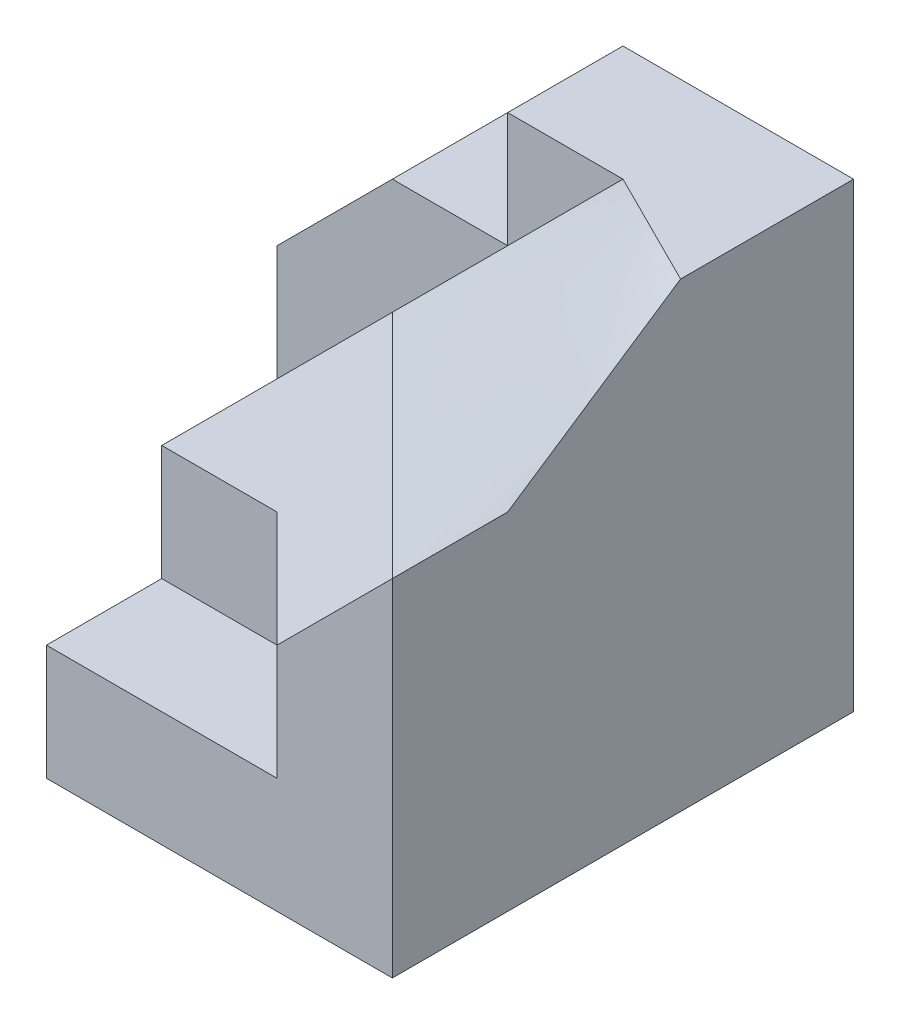
ISO-10303-21;
HEADER;
FILE_DESCRIPTION(('STEP AP214'),'2;1');
FILE_NAME('part.step','',(''),(''),'','','');
FILE_SCHEMA(('AUTOMOTIVE_DESIGN { 1 0 10303 214 1 1 1 1 }'));
ENDSEC;
DATA;
#1=APPLICATION_CONTEXT('core data for automotive mechanical design processes');
#2=APPLICATION_PROTOCOL_DEFINITION('international standard','automotive_design',2000,#1);
#3=PRODUCT_CONTEXT('',#1,'mechanical');
#4=PRODUCT('Part','Part','',(#3));
#5=PRODUCT_RELATED_PRODUCT_CATEGORY('part','',(#4));
#6=PRODUCT_DEFINITION_FORMATION('','',#4);
#7=PRODUCT_DEFINITION_CONTEXT('part definition',#1,'design');
#8=PRODUCT_DEFINITION('design','',#6,#7);
#9=PRODUCT_DEFINITION_SHAPE('','',#8);
#10=(LENGTH_UNIT() NAMED_UNIT(*) SI_UNIT(.MILLI.,.METRE.));
#11=(NAMED_UNIT(*) PLANE_ANGLE_UNIT() SI_UNIT($,.RADIAN.));
#12=(NAMED_UNIT(*) SI_UNIT($,.STERADIAN.) SOLID_ANGLE_UNIT());
#13=UNCERTAINTY_MEASURE_WITH_UNIT(LENGTH_MEASURE(1.E-05),#10,'distance_accuracy_value','');
#14=(GEOMETRIC_REPRESENTATION_CONTEXT(3) GLOBAL_UNCERTAINTY_ASSIGNED_CONTEXT((#13)) GLOBAL_UNIT_ASSIGNED_CONTEXT((#10,
#11,#12)) REPRESENTATION_CONTEXT('',''));
#15=CARTESIAN_POINT('',(0.,0.,0.));
#16=DIRECTION('',(0.,0.,1.));
#17=DIRECTION('',(1.,0.,0.));
#18=AXIS2_PLACEMENT_3D('',#15,#16,#17);
#19=CARTESIAN_POINT('',(10.,20.,15.));
#20=DIRECTION('',(0.,0.,1.));
#21=DIRECTION('',(1.,0.,0.));
#22=AXIS2_PLACEMENT_3D('',#19,#20,#21);
#23=PLANE('',#22);
#24=DIRECTION('',(-1.,0.,0.));
#25=VECTOR('',#24,1.);
#26=CARTESIAN_POINT('',(-5.,5.,15.));
#27=LINE('',#26,#25);
#28=CARTESIAN_POINT('',(-5.07553538217284E-05,5.,15.));
#29=VERTEX_POINT('',#28);
#30=CARTESIAN_POINT('',(-5.,5.,15.));
#31=VERTEX_POINT('',#30);
#32=EDGE_CURVE('E38',#29,#31,#27,.T.);
#33=ORIENTED_EDGE('',*,*,#32,.F.);
#34=DIRECTION('',(0.,-1.,0.));
#35=VECTOR('',#34,1.);
#36=CARTESIAN_POINT('',(-5.07553538217284E-05,10.,15.));
#37=LINE('',#36,#35);
#38=CARTESIAN_POINT('',(-5.07553538217284E-05,10.,15.));
#39=VERTEX_POINT('',#38);
#40=EDGE_CURVE('E59',#39,#29,#37,.T.);
#41=ORIENTED_EDGE('',*,*,#40,.F.);
#42=DIRECTION('',(-1.,0.,0.));
#43=VECTOR('',#42,1.);
#44=CARTESIAN_POINT('',(5.,10.,15.));
#45=LINE('',#44,#43);
#46=CARTESIAN_POINT('',(-5.,10.,15.));
#47=VERTEX_POINT('',#46);
#48=EDGE_CURVE('E286',#39,#47,#45,.T.);
#49=ORIENTED_EDGE('',*,*,#48,.T.);
#50=DIRECTION('',(0.,-1.,0.));
#51=VECTOR('',#50,1.);
#52=CARTESIAN_POINT('',(-5.,20.,15.));
#53=LINE('',#52,#51);
#54=EDGE_CURVE('E287',#47,#31,#53,.T.);
#55=ORIENTED_EDGE('',*,*,#54,.T.);
#56=EDGE_LOOP('',(#33,#41,#49,#55));
#57=FACE_BOUND('',#56,.T.);
#58=ADVANCED_FACE('F33',(#57),#23,.T.);
#59=CARTESIAN_POINT('',(-5.,5.,20.));
#60=DIRECTION('',(0.,-1.,0.));
#61=DIRECTION('',(0.,0.,-1.));
#62=AXIS2_PLACEMENT_3D('',#59,#60,#61);
#63=PLANE('',#62);
#64=DIRECTION('',(0.707106781186547,0.,0.707106781186548));
#65=VECTOR('',#64,1.);
#66=CARTESIAN_POINT('',(4.99994924464618,5.,20.));
#67=LINE('',#66,#65);
#68=CARTESIAN_POINT('',(4.99994924464618,5.,20.));
#69=VERTEX_POINT('',#68);
#70=EDGE_CURVE('E52',#29,#69,#67,.T.);
#71=ORIENTED_EDGE('',*,*,#70,.F.);
#72=ORIENTED_EDGE('',*,*,#32,.T.);
#73=DIRECTION('',(0.,0.,-1.));
#74=VECTOR('',#73,1.);
#75=CARTESIAN_POINT('',(-5.,5.,20.));
#76=LINE('',#75,#74);
#77=CARTESIAN_POINT('',(-5.,5.,20.));
#78=VERTEX_POINT('',#77);
#79=EDGE_CURVE('E225',#78,#31,#76,.T.);
#80=ORIENTED_EDGE('',*,*,#79,.F.);
#81=DIRECTION('',(-1.,0.,0.));
#82=VECTOR('',#81,1.);
#83=CARTESIAN_POINT('',(-5.,5.,20.));
#84=LINE('',#83,#82);
#85=EDGE_CURVE('E224',#69,#78,#84,.T.);
#86=ORIENTED_EDGE('',*,*,#85,.F.);
#87=EDGE_LOOP('',(#71,#72,#80,#86));
#88=FACE_BOUND('',#87,.T.);
#89=ADVANCED_FACE('F264',(#88),#63,.F.);
#90=CARTESIAN_POINT('',(4.99994924464618,5.,20.));
#91=DIRECTION('',(1.,0.,0.));
#92=DIRECTION('',(0.,0.,-1.));
#93=AXIS2_PLACEMENT_3D('',#90,#91,#92);
#94=PLANE('',#93);
#95=DIRECTION('',(0.,0.,-1.));
#96=VECTOR('',#95,1.);
#97=CARTESIAN_POINT('',(4.99994924464618,10.,15.));
#98=LINE('',#97,#96);
#99=CARTESIAN_POINT('',(4.99994924464618,10.,20.));
#100=VERTEX_POINT('',#99);
#101=CARTESIAN_POINT('',(4.9997838308034,10.,15.000221301687));
#102=VERTEX_POINT('',#101);
#103=EDGE_CURVE('E179',#100,#102,#98,.T.);
#104=ORIENTED_EDGE('',*,*,#103,.F.);
#105=DIRECTION('',(0.,-1.,0.));
#106=VECTOR('',#105,1.);
#107=CARTESIAN_POINT('',(4.99994924464618,5.,20.));
#108=LINE('',#107,#106);
#109=CARTESIAN_POINT('',(4.99994924464618,10.0000585638698,20.));
#110=VERTEX_POINT('',#109);
#111=EDGE_CURVE('E181',#110,#100,#108,.T.);
#112=ORIENTED_EDGE('',*,*,#111,.F.);
#113=DIRECTION('',(0.,0.,-1.));
#114=VECTOR('',#113,1.);
#115=CARTESIAN_POINT('',(4.99994924464618,10.0000585638698,20.));
#116=LINE('',#115,#114);
#117=EDGE_CURVE('E177',#110,#102,#116,.T.);
#118=ORIENTED_EDGE('',*,*,#117,.T.);
#119=EDGE_LOOP('',(#104,#112,#118));
#120=FACE_BOUND('',#119,.T.);
#121=ADVANCED_FACE('F178',(#120),#94,.F.);
#122=CARTESIAN_POINT('',(5.,20.,5.));
#123=DIRECTION('',(0.,0.,-1.));
#124=DIRECTION('',(-1.,0.,0.));
#125=AXIS2_PLACEMENT_3D('',#122,#123,#124);
#126=PLANE('',#125);
#127=DIRECTION('',(0.707106781186547,0.707106781186548,0.));
#128=VECTOR('',#127,1.);
#129=CARTESIAN_POINT('',(-10.,10.,5.));
#130=LINE('',#129,#128);
#131=CARTESIAN_POINT('',(-10.,10.,5.));
#132=VERTEX_POINT('',#131);
#133=CARTESIAN_POINT('',(-5.,15.,5.));
#134=VERTEX_POINT('',#133);
#135=EDGE_CURVE('E394',#132,#134,#130,.T.);
#136=ORIENTED_EDGE('',*,*,#135,.F.);
#137=DIRECTION('',(0.,-1.,0.));
#138=VECTOR('',#137,1.);
#139=CARTESIAN_POINT('',(-10.,10.,5.));
#140=LINE('',#139,#138);
#141=CARTESIAN_POINT('',(-10.,5.,5.));
#142=VERTEX_POINT('',#141);
#143=EDGE_CURVE('E375',#132,#142,#140,.T.);
#144=ORIENTED_EDGE('',*,*,#143,.T.);
#145=DIRECTION('',(0.707106781186547,0.707106781186548,0.));
#146=VECTOR('',#145,1.);
#147=CARTESIAN_POINT('',(-10.,5.,5.));
#148=LINE('',#147,#146);
#149=CARTESIAN_POINT('',(-4.99993659023151,9.99992683488251,4.99993171255701));
#150=VERTEX_POINT('',#149);
#151=EDGE_CURVE('E379',#142,#150,#148,.T.);
#152=ORIENTED_EDGE('',*,*,#151,.T.);
#153=CARTESIAN_POINT('',(0.000267019697488768,14.9997314073177,4.99973219381008));
#154=CARTESIAN_POINT('',(-0.208058660414367,14.7913965868046,4.9997276236095));
#155=CARTESIAN_POINT('',(-0.416465346316192,14.5831428484161,4.99980409736613));
#156=CARTESIAN_POINT('',(-0.833305417631473,14.1666661788245,4.99998579822799));
#157=CARTESIAN_POINT('',(-1.04173880276355,13.9584432473398,5.0000910250517));
#158=CARTESIAN_POINT('',(-1.45850646313155,13.5418873448492,5.0001969039904));
#159=CARTESIAN_POINT('',(-1.66684073564951,13.3335543711229,5.00019755338619));
#160=CARTESIAN_POINT('',(-2.08344605673748,12.9168165752041,5.0001313159708));
#161=CARTESIAN_POINT('',(-2.29171710389934,12.7084117516048,5.00006442775209));
#162=CARTESIAN_POINT('',(-2.70826946388126,12.2916135903911,4.99994152713617));
#163=CARTESIAN_POINT('',(-2.91655077666897,12.0832202527443,4.99988551470663));
#164=CARTESIAN_POINT('',(-3.3331845665953,11.666514001042,4.99984928381867));
#165=CARTESIAN_POINT('',(-3.54153704204514,11.4582010852983,4.99986906367172));
#166=CARTESIAN_POINT('',(-3.95831435213359,11.0416535502852,4.99998395120941));
#167=CARTESIAN_POINT('',(-4.16673918570646,10.8334189299496,5.00007905782801));
#168=CARTESIAN_POINT('',(-4.58346960460036,10.4168120935813,5.00014084909085));
#169=CARTESIAN_POINT('',(-4.79177518426433,10.208439871892,5.00010752807815));
#170=CARTESIAN_POINT('',(-4.99991466554323,9.99990153716526,4.99990810135424));
#171=B_SPLINE_CURVE_WITH_KNOTS('',3,(#153,#154,#155,#156,#157,#158,#159,#160,#161,#162,#163,
#164,#165,#166,#167,#168,#169,#170),.UNSPECIFIED.,.F.,.F.,(4,2,2,2,2,2,2,2,4),(0.,
0.883870323287121,1.76773199316225,2.65161664498434,3.53551971792437,4.41942016360728,
5.30330091766094,6.1871691630483,7.0710763412778),.UNSPECIFIED.);
#172=CARTESIAN_POINT('',(8.79215899871924E-06,14.9997409398658,4.99954435897835));
#173=VERTEX_POINT('',#172);
#174=EDGE_CURVE('E166',#173,#150,#171,.T.);
#175=ORIENTED_EDGE('',*,*,#174,.F.);
#176=DIRECTION('',(1.,0.,0.));
#177=VECTOR('',#176,1.);
#178=CARTESIAN_POINT('',(-10.,15.,5.));
#179=LINE('',#178,#177);
#180=EDGE_CURVE('E400',#134,#173,#179,.T.);
#181=ORIENTED_EDGE('',*,*,#180,.F.);
#182=EDGE_LOOP('',(#136,#144,#152,#175,#181));
#183=FACE_BOUND('',#182,.T.);
#184=ADVANCED_FACE('F451',(#183),#126,.F.);
#185=CARTESIAN_POINT('',(10.,20.,0.));
#186=DIRECTION('',(-1.,0.,0.));
#187=DIRECTION('',(0.,0.,1.));
#188=AXIS2_PLACEMENT_3D('',#185,#186,#187);
#189=PLANE('',#188);
#190=CARTESIAN_POINT('',(10.0002258887101,14.9997393591806,14.9997567352352));
#191=CARTESIAN_POINT('',(9.99989931544445,15.2084787118504,14.6875646234766));
#192=CARTESIAN_POINT('',(9.99983475675311,15.4168785515128,14.375146124924));
#193=CARTESIAN_POINT('',(9.99989222067025,15.8334629450422,13.7501081936318));
#194=CARTESIAN_POINT('',(10.000014266989,16.0416474681872,13.4374887404039));
#195=CARTESIAN_POINT('',(10.0001074022782,16.4582020331015,12.8123953977974));
#196=CARTESIAN_POINT('',(10.0000784985747,16.6665720653767,12.4999215020905));
#197=CARTESIAN_POINT('',(10.0000111297537,17.0833217485705,11.8749861282203));
#198=CARTESIAN_POINT('',(9.99997266476329,17.2917013993245,11.5625246499471));
#199=CARTESIAN_POINT('',(9.99996788920212,17.7083729325973,10.9375307583442));
#200=CARTESIAN_POINT('',(10.0000015806196,17.9166648125396,10.624998343297));
#201=CARTESIAN_POINT('',(10.0000324812828,18.333290076531,9.99997368775559));
#202=CARTESIAN_POINT('',(10.0000296915456,18.5416234592611,9.68748144638418));
#203=CARTESIAN_POINT('',(9.99989674830032,18.8542855048358,9.21886164174922));
#204=CARTESIAN_POINT('',(9.99983097709315,18.9585307922104,9.06267837599985));
#205=CARTESIAN_POINT('',(9.99977314201993,19.1669375304943,8.75023065166417));
#206=CARTESIAN_POINT('',(9.99978108631876,19.2710989708387,8.59396618600081));
#207=CARTESIAN_POINT('',(10.0000326991656,19.4791347537077,8.28120606024287));
#208=CARTESIAN_POINT('',(10.0002764104029,19.5830090408227,8.12471036340408));
#209=CARTESIAN_POINT('',(10.0004728648739,19.739028131641,7.89013014346946));
#210=CARTESIAN_POINT('',(10.0005101698614,19.791062963579,7.81197315463619));
#211=CARTESIAN_POINT('',(10.0002898197755,19.8954730110732,7.6559767586361));
#212=CARTESIAN_POINT('',(10.0000323965768,19.9478479268563,7.57813715009606));
#213=CARTESIAN_POINT('',(9.99950860937919,20.0005669888699,7.50052919036129));
#214=B_SPLINE_CURVE_WITH_KNOTS('',3,(#190,#191,#192,#193,#194,#195,#196,#197,#198,#199,#200,
#201,#202,#203,#204,#205,#206,#207,#208,#209,#210,#211,#212,#213),.UNSPECIFIED.,.F.,.F.,(4,2,2,
2,2,2,2,2,2,2,2,4),(0.,1.12664219270157,2.25342754978272,3.38015822185135,4.50687392120386,
5.63362066782605,6.76033600066701,7.32366785996524,7.88706211571614,8.45055840195985,
8.7322401912162,9.01370052203157),.UNSPECIFIED.);
#215=CARTESIAN_POINT('',(10.,14.9995139010449,15.));
#216=VERTEX_POINT('',#215);
#217=CARTESIAN_POINT('',(10.,20.,7.50080606773796));
#218=VERTEX_POINT('',#217);
#219=EDGE_CURVE('E191',#216,#218,#214,.T.);
#220=ORIENTED_EDGE('',*,*,#219,.F.);
#221=DIRECTION('',(0.,0.,-1.));
#222=VECTOR('',#221,1.);
#223=CARTESIAN_POINT('',(10.,14.99967593403,20.));
#224=LINE('',#223,#222);
#225=CARTESIAN_POINT('',(10.,14.99967593403,20.));
#226=VERTEX_POINT('',#225);
#227=EDGE_CURVE('E184',#226,#216,#224,.T.);
#228=ORIENTED_EDGE('',*,*,#227,.F.);
#229=DIRECTION('',(0.,1.,0.));
#230=VECTOR('',#229,1.);
#231=CARTESIAN_POINT('',(10.,5.,20.));
#232=LINE('',#231,#230);
#233=CARTESIAN_POINT('',(10.,0.,20.));
#234=VERTEX_POINT('',#233);
#235=EDGE_CURVE('E222',#234,#226,#232,.T.);
#236=ORIENTED_EDGE('',*,*,#235,.F.);
#237=DIRECTION('',(0.,0.,-1.));
#238=VECTOR('',#237,1.);
#239=CARTESIAN_POINT('',(10.,0.,0.));
#240=LINE('',#239,#238);
#241=CARTESIAN_POINT('',(10.,0.,0.));
#242=VERTEX_POINT('',#241);
#243=EDGE_CURVE('E429',#234,#242,#240,.T.);
#244=ORIENTED_EDGE('',*,*,#243,.T.);
#245=DIRECTION('',(0.,-1.,0.));
#246=VECTOR('',#245,1.);
#247=CARTESIAN_POINT('',(10.,20.,0.));
#248=LINE('',#247,#246);
#249=CARTESIAN_POINT('',(10.,20.,0.));
#250=VERTEX_POINT('',#249);
#251=EDGE_CURVE('E426',#250,#242,#248,.T.);
#252=ORIENTED_EDGE('',*,*,#251,.F.);
#253=DIRECTION('',(0.,0.,-1.));
#254=VECTOR('',#253,1.);
#255=CARTESIAN_POINT('',(10.,20.,0.));
#256=LINE('',#255,#254);
#257=EDGE_CURVE('E430',#218,#250,#256,.T.);
#258=ORIENTED_EDGE('',*,*,#257,.F.);
#259=EDGE_LOOP('',(#220,#228,#236,#244,#252,#258));
#260=FACE_BOUND('',#259,.T.);
#261=ADVANCED_FACE('F35',(#260),#189,.F.);
#262=CARTESIAN_POINT('',(0.,20.,0.));
#263=DIRECTION('',(0.,-1.,0.));
#264=DIRECTION('',(0.,0.,-1.));
#265=AXIS2_PLACEMENT_3D('',#262,#263,#264);
#266=PLANE('',#265);
#267=CARTESIAN_POINT('',(9.99950860937596,20.0005669891816,7.5005291899028));
#268=CARTESIAN_POINT('',(9.79163290147061,19.9998931768866,7.39567045914693));
#269=CARTESIAN_POINT('',(9.58348605606344,19.999714802277,7.29135325781026));
#270=CARTESIAN_POINT('',(9.16685267854684,19.9997499788738,7.08308464373423));
#271=CARTESIAN_POINT('',(8.95836601748139,19.9999637656358,6.9791334884429));
#272=CARTESIAN_POINT('',(8.54153427639803,20.0001836702695,6.77101815423397));
#273=CARTESIAN_POINT('',(8.33318918108827,20.0001898161193,6.66685400590716));
#274=CARTESIAN_POINT('',(7.91657533068559,20.0001149877656,6.45844481528915));
#275=CARTESIAN_POINT('',(7.70830656903248,20.0000340255521,6.35419978610416));
#276=CARTESIAN_POINT('',(7.29175064869152,19.9998901906992,6.14572525163471));
#277=CARTESIAN_POINT('',(7.08346348960002,19.9998273187947,6.04149574715271));
#278=CARTESIAN_POINT('',(6.66675691439989,19.9998751998816,5.8332078970381));
#279=CARTESIAN_POINT('',(6.45833748125645,19.9999859840581,5.72914958550764));
#280=CARTESIAN_POINT('',(6.04151293913319,20.000195893376,5.52102419051378));
#281=CARTESIAN_POINT('',(5.83310782991106,20.0002950189676,5.41695710754451));
#282=CARTESIAN_POINT('',(5.41653817283608,20.0002156350948,5.20856378771429));
#283=CARTESIAN_POINT('',(5.20837356038323,20.0000372436277,5.10423767981608));
#284=CARTESIAN_POINT('',(5.00035766050937,19.9995873147969,4.99961482714375));
#285=B_SPLINE_CURVE_WITH_KNOTS('',3,(#267,#268,#269,#270,#271,#272,#273,#274,#275,#276,#277,
#278,#279,#280,#281,#282,#283,#284),.UNSPECIFIED.,.F.,.F.,(4,2,2,2,2,2,2,2,4),(0.,
0.698473889705523,1.39736746211624,2.09616686339957,2.7948700908577,3.49360169599927,
4.19245879328016,4.89128889407521,5.5898219414062),.UNSPECIFIED.);
#286=CARTESIAN_POINT('',(5.00017883025469,19.9998968286992,4.99990370678594));
#287=VERTEX_POINT('',#286);
#288=EDGE_CURVE('E707',#218,#287,#285,.T.);
#289=ORIENTED_EDGE('',*,*,#288,.F.);
#290=ORIENTED_EDGE('',*,*,#257,.T.);
#291=DIRECTION('',(-1.,0.,0.));
#292=VECTOR('',#291,1.);
#293=CARTESIAN_POINT('',(0.,20.,0.));
#294=LINE('',#293,#292);
#295=CARTESIAN_POINT('',(0.,20.,0.));
#296=VERTEX_POINT('',#295);
#297=EDGE_CURVE('E431',#250,#296,#294,.T.);
#298=ORIENTED_EDGE('',*,*,#297,.T.);
#299=DIRECTION('',(0.,0.,1.));
#300=VECTOR('',#299,1.);
#301=CARTESIAN_POINT('',(0.,20.,5.));
#302=LINE('',#301,#300);
#303=CARTESIAN_POINT('',(0.,20.,5.));
#304=VERTEX_POINT('',#303);
#305=EDGE_CURVE('E288',#296,#304,#302,.T.);
#306=ORIENTED_EDGE('',*,*,#305,.T.);
#307=DIRECTION('',(-1.,0.,0.));
#308=VECTOR('',#307,1.);
#309=CARTESIAN_POINT('',(5.,20.,5.));
#310=LINE('',#309,#308);
#311=EDGE_CURVE('E44',#287,#304,#310,.T.);
#312=ORIENTED_EDGE('',*,*,#311,.F.);
#313=EDGE_LOOP('',(#289,#290,#298,#306,#312));
#314=FACE_BOUND('',#313,.T.);
#315=ADVANCED_FACE('F246',(#314),#266,.F.);
#316=CARTESIAN_POINT('',(0.,20.,5.));
#317=DIRECTION('',(1.,0.,0.));
#318=DIRECTION('',(0.,0.,-1.));
#319=AXIS2_PLACEMENT_3D('',#316,#317,#318);
#320=PLANE('',#319);
#321=DIRECTION('',(0.,0.,-1.));
#322=VECTOR('',#321,1.);
#323=CARTESIAN_POINT('',(0.,15.,5.));
#324=LINE('',#323,#322);
#325=CARTESIAN_POINT('',(0.,15.,0.));
#326=VERTEX_POINT('',#325);
#327=EDGE_CURVE('E408',#173,#326,#324,.T.);
#328=ORIENTED_EDGE('',*,*,#327,.F.);
#329=DIRECTION('',(0.,-1.,0.));
#330=VECTOR('',#329,1.);
#331=CARTESIAN_POINT('',(0.,20.,5.));
#332=LINE('',#331,#330);
#333=EDGE_CURVE('E11',#304,#173,#332,.T.);
#334=ORIENTED_EDGE('',*,*,#333,.F.);
#335=ORIENTED_EDGE('',*,*,#305,.F.);
#336=DIRECTION('',(0.,-1.,0.));
#337=VECTOR('',#336,1.);
#338=CARTESIAN_POINT('',(0.,20.,0.));
#339=LINE('',#338,#337);
#340=EDGE_CURVE('E378',#296,#326,#339,.T.);
#341=ORIENTED_EDGE('',*,*,#340,.T.);
#342=EDGE_LOOP('',(#328,#334,#335,#341));
#343=FACE_BOUND('',#342,.T.);
#344=ADVANCED_FACE('F255',(#343),#320,.F.);
#345=CARTESIAN_POINT('',(0.,20.,0.));
#346=DIRECTION('',(0.,0.,1.));
#347=DIRECTION('',(1.,0.,0.));
#348=AXIS2_PLACEMENT_3D('',#345,#346,#347);
#349=PLANE('',#348);
#350=DIRECTION('',(0.,-1.,0.));
#351=VECTOR('',#350,1.);
#352=CARTESIAN_POINT('',(-10.,15.,0.));
#353=LINE('',#352,#351);
#354=CARTESIAN_POINT('',(-10.,10.,0.));
#355=VERTEX_POINT('',#354);
#356=CARTESIAN_POINT('',(-10.,0.,0.));
#357=VERTEX_POINT('',#356);
#358=EDGE_CURVE('E405',#355,#357,#353,.T.);
#359=ORIENTED_EDGE('',*,*,#358,.F.);
#360=DIRECTION('',(0.707106781186547,0.707106781186548,0.));
#361=VECTOR('',#360,1.);
#362=CARTESIAN_POINT('',(0.,20.,0.));
#363=LINE('',#362,#361);
#364=CARTESIAN_POINT('',(-5.,15.,0.));
#365=VERTEX_POINT('',#364);
#366=EDGE_CURVE('E401',#355,#365,#363,.T.);
#367=ORIENTED_EDGE('',*,*,#366,.T.);
#368=DIRECTION('',(1.,0.,0.));
#369=VECTOR('',#368,1.);
#370=CARTESIAN_POINT('',(-10.,15.,0.));
#371=LINE('',#370,#369);
#372=EDGE_CURVE('E404',#365,#326,#371,.T.);
#373=ORIENTED_EDGE('',*,*,#372,.T.);
#374=ORIENTED_EDGE('',*,*,#340,.F.);
#375=ORIENTED_EDGE('',*,*,#297,.F.);
#376=ORIENTED_EDGE('',*,*,#251,.T.);
#377=DIRECTION('',(-1.,0.,0.));
#378=VECTOR('',#377,1.);
#379=CARTESIAN_POINT('',(0.,0.,0.));
#380=LINE('',#379,#378);
#381=EDGE_CURVE('E374',#242,#357,#380,.T.);
#382=ORIENTED_EDGE('',*,*,#381,.T.);
#383=EDGE_LOOP('',(#359,#367,#373,#374,#375,#376,#382));
#384=FACE_BOUND('',#383,.T.);
#385=ADVANCED_FACE('F462',(#384),#349,.F.);
#386=CARTESIAN_POINT('',(0.,0.,0.));
#387=DIRECTION('',(0.,-1.,0.));
#388=DIRECTION('',(0.,0.,-1.));
#389=AXIS2_PLACEMENT_3D('',#386,#387,#388);
#390=PLANE('',#389);
#391=ORIENTED_EDGE('',*,*,#243,.F.);
#392=DIRECTION('',(1.,0.,0.));
#393=VECTOR('',#392,1.);
#394=CARTESIAN_POINT('',(10.,0.,20.));
#395=LINE('',#394,#393);
#396=CARTESIAN_POINT('',(-5.,0.,20.));
#397=VERTEX_POINT('',#396);
#398=EDGE_CURVE('E219',#397,#234,#395,.T.);
#399=ORIENTED_EDGE('',*,*,#398,.F.);
#400=DIRECTION('',(0.,0.,-1.));
#401=VECTOR('',#400,1.);
#402=CARTESIAN_POINT('',(-5.,0.,5.));
#403=LINE('',#402,#401);
#404=CARTESIAN_POINT('',(-5.,0.,10.));
#405=VERTEX_POINT('',#404);
#406=EDGE_CURVE('E370',#397,#405,#403,.T.);
#407=ORIENTED_EDGE('',*,*,#406,.T.);
#408=DIRECTION('',(1.,0.,0.));
#409=VECTOR('',#408,1.);
#410=CARTESIAN_POINT('',(-5.,0.,10.));
#411=LINE('',#410,#409);
#412=CARTESIAN_POINT('',(-10.,0.,10.));
#413=VERTEX_POINT('',#412);
#414=EDGE_CURVE('E384',#413,#405,#411,.T.);
#415=ORIENTED_EDGE('',*,*,#414,.F.);
#416=DIRECTION('',(0.,0.,1.));
#417=VECTOR('',#416,1.);
#418=CARTESIAN_POINT('',(-10.,0.,0.));
#419=LINE('',#418,#417);
#420=EDGE_CURVE('E407',#357,#413,#419,.T.);
#421=ORIENTED_EDGE('',*,*,#420,.F.);
#422=ORIENTED_EDGE('',*,*,#381,.F.);
#423=EDGE_LOOP('',(#391,#399,#407,#415,#421,#422));
#424=FACE_BOUND('',#423,.T.);
#425=ADVANCED_FACE('F465',(#424),#390,.T.);
#426=CARTESIAN_POINT('',(-10.,15.,5.));
#427=DIRECTION('',(0.,-1.,0.));
#428=DIRECTION('',(0.,0.,-1.));
#429=AXIS2_PLACEMENT_3D('',#426,#427,#428);
#430=PLANE('',#429);
#431=ORIENTED_EDGE('',*,*,#372,.F.);
#432=DIRECTION('',(0.,0.,1.));
#433=VECTOR('',#432,1.);
#434=CARTESIAN_POINT('',(-5.,15.,-5.));
#435=LINE('',#434,#433);
#436=EDGE_CURVE('E373',#365,#134,#435,.T.);
#437=ORIENTED_EDGE('',*,*,#436,.T.);
#438=ORIENTED_EDGE('',*,*,#180,.T.);
#439=ORIENTED_EDGE('',*,*,#327,.T.);
#440=EDGE_LOOP('',(#431,#437,#438,#439));
#441=FACE_BOUND('',#440,.T.);
#442=ADVANCED_FACE('F469',(#441),#430,.F.);
#443=CARTESIAN_POINT('',(-10.,0.,0.));
#444=DIRECTION('',(-1.,0.,0.));
#445=DIRECTION('',(0.,0.,1.));
#446=AXIS2_PLACEMENT_3D('',#443,#444,#445);
#447=PLANE('',#446);
#448=DIRECTION('',(0.,0.,1.));
#449=VECTOR('',#448,1.);
#450=CARTESIAN_POINT('',(-10.,5.,5.));
#451=LINE('',#450,#449);
#452=CARTESIAN_POINT('',(-10.,5.,10.));
#453=VERTEX_POINT('',#452);
#454=EDGE_CURVE('E385',#142,#453,#451,.T.);
#455=ORIENTED_EDGE('',*,*,#454,.F.);
#456=ORIENTED_EDGE('',*,*,#143,.F.);
#457=DIRECTION('',(0.,0.,1.));
#458=VECTOR('',#457,1.);
#459=CARTESIAN_POINT('',(-10.,10.,0.));
#460=LINE('',#459,#458);
#461=EDGE_CURVE('E397',#355,#132,#460,.T.);
#462=ORIENTED_EDGE('',*,*,#461,.F.);
#463=ORIENTED_EDGE('',*,*,#358,.T.);
#464=ORIENTED_EDGE('',*,*,#420,.T.);
#465=DIRECTION('',(0.,-1.,0.));
#466=VECTOR('',#465,1.);
#467=CARTESIAN_POINT('',(-10.,0.,10.));
#468=LINE('',#467,#466);
#469=EDGE_CURVE('E387',#453,#413,#468,.T.);
#470=ORIENTED_EDGE('',*,*,#469,.F.);
#471=EDGE_LOOP('',(#455,#456,#462,#463,#464,#470));
#472=FACE_BOUND('',#471,.T.);
#473=ADVANCED_FACE('F473',(#472),#447,.T.);
#474=CARTESIAN_POINT('',(-10.,10.,-5.));
#475=DIRECTION('',(0.707106781186548,-0.707106781186547,0.));
#476=DIRECTION('',(0.707106781186547,0.707106781186548,0.));
#477=AXIS2_PLACEMENT_3D('',#474,#475,#476);
#478=PLANE('',#477);
#479=ORIENTED_EDGE('',*,*,#461,.T.);
#480=ORIENTED_EDGE('',*,*,#135,.T.);
#481=ORIENTED_EDGE('',*,*,#436,.F.);
#482=ORIENTED_EDGE('',*,*,#366,.F.);
#483=EDGE_LOOP('',(#479,#480,#481,#482));
#484=FACE_BOUND('',#483,.T.);
#485=ADVANCED_FACE('F477',(#484),#478,.F.);
#486=CARTESIAN_POINT('',(0.,0.,10.));
#487=DIRECTION('',(0.,0.,-1.));
#488=DIRECTION('',(-1.,0.,0.));
#489=AXIS2_PLACEMENT_3D('',#486,#487,#488);
#490=PLANE('',#489);
#491=DIRECTION('',(0.,1.,0.));
#492=VECTOR('',#491,1.);
#493=CARTESIAN_POINT('',(-5.,10.,10.));
#494=LINE('',#493,#492);
#495=CARTESIAN_POINT('',(-5.,10.,10.));
#496=VERTEX_POINT('',#495);
#497=EDGE_CURVE('E389',#405,#496,#494,.T.);
#498=ORIENTED_EDGE('',*,*,#497,.T.);
#499=DIRECTION('',(0.707106781186547,0.707106781186548,0.));
#500=VECTOR('',#499,1.);
#501=CARTESIAN_POINT('',(-10.,5.,10.));
#502=LINE('',#501,#500);
#503=EDGE_CURVE('E380',#453,#496,#502,.T.);
#504=ORIENTED_EDGE('',*,*,#503,.F.);
#505=ORIENTED_EDGE('',*,*,#469,.T.);
#506=ORIENTED_EDGE('',*,*,#414,.T.);
#507=EDGE_LOOP('',(#498,#504,#505,#506));
#508=FACE_BOUND('',#507,.T.);
#509=ADVANCED_FACE('F480',(#508),#490,.F.);
#510=CARTESIAN_POINT('',(-10.,5.,5.));
#511=DIRECTION('',(0.707106781186548,-0.707106781186547,0.));
#512=DIRECTION('',(0.707106781186547,0.707106781186548,0.));
#513=AXIS2_PLACEMENT_3D('',#510,#511,#512);
#514=PLANE('',#513);
#515=ORIENTED_EDGE('',*,*,#503,.T.);
#516=DIRECTION('',(0.,0.,-1.));
#517=VECTOR('',#516,1.);
#518=CARTESIAN_POINT('',(-5.,10.,10.));
#519=LINE('',#518,#517);
#520=EDGE_CURVE('E383',#496,#150,#519,.T.);
#521=ORIENTED_EDGE('',*,*,#520,.T.);
#522=ORIENTED_EDGE('',*,*,#151,.F.);
#523=ORIENTED_EDGE('',*,*,#454,.T.);
#524=EDGE_LOOP('',(#515,#521,#522,#523));
#525=FACE_BOUND('',#524,.T.);
#526=ADVANCED_FACE('F260',(#525),#514,.F.);
#527=CARTESIAN_POINT('',(-5.,20.,5.));
#528=DIRECTION('',(-1.,0.,0.));
#529=DIRECTION('',(0.,0.,1.));
#530=AXIS2_PLACEMENT_3D('',#527,#528,#529);
#531=PLANE('',#530);
#532=DIRECTION('',(0.,0.,1.));
#533=VECTOR('',#532,1.);
#534=CARTESIAN_POINT('',(-5.,10.,5.00000000000001));
#535=LINE('',#534,#533);
#536=EDGE_CURVE('E192',#496,#47,#535,.T.);
#537=ORIENTED_EDGE('',*,*,#536,.F.);
#538=ORIENTED_EDGE('',*,*,#497,.F.);
#539=ORIENTED_EDGE('',*,*,#406,.F.);
#540=DIRECTION('',(0.,-1.,0.));
#541=VECTOR('',#540,1.);
#542=CARTESIAN_POINT('',(-5.,0.,20.));
#543=LINE('',#542,#541);
#544=EDGE_CURVE('E216',#78,#397,#543,.T.);
#545=ORIENTED_EDGE('',*,*,#544,.F.);
#546=ORIENTED_EDGE('',*,*,#79,.T.);
#547=ORIENTED_EDGE('',*,*,#54,.F.);
#548=EDGE_LOOP('',(#537,#538,#539,#545,#546,#547));
#549=FACE_BOUND('',#548,.T.);
#550=ADVANCED_FACE('F257',(#549),#531,.T.);
#551=CARTESIAN_POINT('',(-5.,10.,5.));
#552=DIRECTION('',(0.,-1.,0.));
#553=DIRECTION('',(0.,0.,-1.));
#554=AXIS2_PLACEMENT_3D('',#551,#552,#553);
#555=PLANE('',#554);
#556=ORIENTED_EDGE('',*,*,#520,.F.);
#557=ORIENTED_EDGE('',*,*,#536,.T.);
#558=ORIENTED_EDGE('',*,*,#48,.F.);
#559=DIRECTION('',(0.707106781186547,0.,0.707106781186548));
#560=VECTOR('',#559,1.);
#561=CARTESIAN_POINT('',(4.99994924464618,10.,20.));
#562=LINE('',#561,#560);
#563=EDGE_CURVE('E198',#39,#100,#562,.T.);
#564=ORIENTED_EDGE('',*,*,#563,.T.);
#565=ORIENTED_EDGE('',*,*,#103,.T.);
#566=CARTESIAN_POINT('',(-4.99991466554323,9.99990153716527,4.99990810135424));
#567=CARTESIAN_POINT('',(-4.58327193994,9.9999291235409,5.41660048243364));
#568=CARTESIAN_POINT('',(-4.16663159758555,9.99995935919248,5.83329524896092));
#569=CARTESIAN_POINT('',(-3.33333673980218,10.0000034769495,6.66666951870695));
#570=CARTESIAN_POINT('',(-2.91668222439255,10.0000173590764,7.083349021945));
#571=CARTESIAN_POINT('',(-2.08333973013762,10.0000071178811,7.91667308204828));
#572=CARTESIAN_POINT('',(-1.66665175135316,9.99998299462639,8.33331763897435));
#573=CARTESIAN_POINT('',(-0.833306935253814,9.99996970244996,9.16663852915613));
#574=CARTESIAN_POINT('',(-0.416650097962896,9.99998053355483,9.58331486243581));
#575=CARTESIAN_POINT('',(0.416703413504834,9.9999575771204,10.4166270523215));
#576=CARTESIAN_POINT('',(0.833400087650624,9.99992378961556,10.8332629089586));
#577=CARTESIAN_POINT('',(1.66671823452476,9.99994175789985,11.6666133987445));
#578=CARTESIAN_POINT('',(2.08333970692108,9.99999351405784,12.0833280322252));
#579=CARTESIAN_POINT('',(2.91655833686461,10.0001224228145,12.9167786979307));
#580=CARTESIAN_POINT('',(3.3331554944928,10.0001995753231,13.3335147300744));
#581=CARTESIAN_POINT('',(3.95835420788203,9.99997585062295,13.9583107390033));
#582=CARTESIAN_POINT('',(4.16680302771947,9.99984470194496,14.1665234912204));
#583=CARTESIAN_POINT('',(4.5835148688184,9.99979678806524,14.5831490873358));
#584=CARTESIAN_POINT('',(4.7917778834213,9.99988003026036,14.79156193789));
#585=CARTESIAN_POINT('',(4.99979697858472,10.0002342554792,15.0002186384472));
#586=B_SPLINE_CURVE_WITH_KNOTS('',3,(#566,#567,#568,#569,#570,#571,#572,#573,#574,#575,#576,
#577,#578,#579,#580,#581,#582,#583,#584,#585),.UNSPECIFIED.,.F.,.F.,(4,2,2,2,2,2,2,2,2,4),(0.,
1.76777072331766,3.535539129875,5.30330439192821,7.07107100112889,8.83883624473996,
10.6066091110613,12.3743757084601,13.2582484359328,14.142151658886),.UNSPECIFIED.);
#587=EDGE_CURVE('E156',#150,#102,#586,.T.);
#588=ORIENTED_EDGE('',*,*,#587,.F.);
#589=EDGE_LOOP('',(#556,#557,#558,#564,#565,#588));
#590=FACE_BOUND('',#589,.T.);
#591=ADVANCED_FACE('F196',(#590),#555,.F.);
#592=CARTESIAN_POINT('',(-0.172002880453976,4.93434609907043,15.2025865990224));
#593=CARTESIAN_POINT('',(-0.670469575529322,5.43633330030541,14.2737383636295));
#594=CARTESIAN_POINT('',(-1.15730393307148,5.92489857361752,13.3323629955086));
#595=CARTESIAN_POINT('',(-1.63217143618203,6.39965593797012,12.3781002456921));
#596=CARTESIAN_POINT('',(-2.29150946895763,7.05648836831382,11.0060092292114));
#597=CARTESIAN_POINT('',(-2.93866714451758,7.6992665403318,9.62080090496004));
#598=CARTESIAN_POINT('',(-3.12955813557624,7.88874983100783,9.20988698133508));
#599=CARTESIAN_POINT('',(-3.64675687856133,8.40201046358576,8.09407373660222));
#600=CARTESIAN_POINT('',(-4.16544746201132,8.9169924505463,6.97986708929311));
#601=CARTESIAN_POINT('',(-4.49593735638006,9.24559534142012,6.27947161389233));
#602=CARTESIAN_POINT('',(-4.83244980025175,9.58114732787429,5.58556196103307));
#603=CARTESIAN_POINT('',(-5.17567068065548,9.92443981801935,4.89887677828524));
#604=CARTESIAN_POINT('',(0.885515925463134,5.9223380165844,15.1679418909696));
#605=CARTESIAN_POINT('',(0.388755329867943,6.42235664149616,14.237256317675));
#606=CARTESIAN_POINT('',(-0.0963630597936832,6.9089419518692,13.2940329841442));
#607=CARTESIAN_POINT('',(-0.570103216724442,7.38239853216823,12.338556169211));
#608=CARTESIAN_POINT('',(-1.22931576880327,8.03908617709261,10.9663300196723));
#609=CARTESIAN_POINT('',(-1.8799098816445,8.68582946905058,9.58482247403153));
#610=CARTESIAN_POINT('',(-2.07213742591872,8.87685493651377,9.17534791540795));
#611=CARTESIAN_POINT('',(-2.59415866654865,9.39567998945125,8.06472812967712));
#612=CARTESIAN_POINT('',(-3.12064541185936,9.91965754778946,6.95891734898729));
#613=CARTESIAN_POINT('',(-3.45730641860366,10.255380952943,6.26516768691395));
#614=CARTESIAN_POINT('',(-3.80180703053846,10.600150056393,5.57986067658419));
#615=CARTESIAN_POINT('',(-4.15317409512764,10.9528419898288,4.90194830757448));
#616=CARTESIAN_POINT('',(1.93884059370532,6.91516932372331,15.1378139465666));
#617=CARTESIAN_POINT('',(1.44432994212781,7.41259185938387,14.2047053566375));
#618=CARTESIAN_POINT('',(0.961289873831772,7.89677910664292,13.259243830867));
#619=CARTESIAN_POINT('',(0.490044208898135,8.36735742694523,12.3010806399369));
#620=CARTESIAN_POINT('',(-0.167796809071122,9.02246253251244,10.9273774536647));
#621=CARTESIAN_POINT('',(-0.820543009441859,9.67168900238908,9.54818754074815));
#622=CARTESIAN_POINT('',(-1.01390878796832,9.86402781706641,9.1399387728577));
#623=CARTESIAN_POINT('',(-1.53967480240274,10.387173762855,8.03335182045496));
#624=CARTESIAN_POINT('',(-2.07376243122065,10.9199215713943,6.93572660661869));
#625=CARTESIAN_POINT('',(-2.41649814671295,11.262654255872,6.24851893858163));
#626=CARTESIAN_POINT('',(-2.76658043563509,11.613863755846,5.56922296500745));
#627=CARTESIAN_POINT('',(-3.12491143361516,11.9745909970406,4.89881021657243));
#628=CARTESIAN_POINT('',(2.98836016498954,7.91239112735225,15.1117837988875));
#629=CARTESIAN_POINT('',(2.4965242155617,8.40672746822485,14.1757947604897));
#630=CARTESIAN_POINT('',(2.01597069710329,8.88804561951717,13.2276554118169));
#631=CARTESIAN_POINT('',(1.54685480976625,9.35616650413121,12.2671986142444));
#632=CARTESIAN_POINT('',(0.893145047524985,10.0065047761662,10.8890463833422));
#633=CARTESIAN_POINT('',(0.23973898699559,10.656492623149,9.51056708905787));
#634=CARTESIAN_POINT('',(0.0459201214905334,10.849354230494,9.10280626099058));
#635=CARTESIAN_POINT('',(-0.483391746382935,11.3765915456356,8.0000379199835));
#636=CARTESIAN_POINT('',(-1.02437893408546,11.9173003836567,6.9098430003309));
#637=CARTESIAN_POINT('',(-1.37459364582949,12.2686626791944,6.23068963594946));
#638=CARTESIAN_POINT('',(-1.73524901129428,12.6320718828713,5.56278005249805));
#639=CARTESIAN_POINT('',(-2.10635474720655,13.0075392062954,4.906124714144));
#640=CARTESIAN_POINT('',(5.0336870982944,9.91445651968026,15.0903875780675));
#641=CARTESIAN_POINT('',(4.54698301799253,10.4028714730998,14.14887191138));
#642=CARTESIAN_POINT('',(4.07977403746161,10.86879208063,13.1863615218626));
#643=CARTESIAN_POINT('',(3.6333032820381,11.3107839668824,12.2015176591525));
#644=CARTESIAN_POINT('',(2.99247730435454,11.9462563336586,10.8094905833419));
#645=CARTESIAN_POINT('',(2.34157285177697,12.5933577099278,9.42831724972489));
#646=CARTESIAN_POINT('',(2.14707968718538,12.7869973546803,9.02128258990457));
#647=CARTESIAN_POINT('',(1.61379387966127,13.3188199848033,7.92279387621367));
#648=CARTESIAN_POINT('',(1.05712313883078,13.8776252302799,6.84948893685251));
#649=CARTESIAN_POINT('',(0.694640850478664,14.2431424219037,6.18354680881832));
#650=CARTESIAN_POINT('',(0.31553209598411,14.6278439975381,5.53551010586051));
#651=CARTESIAN_POINT('',(-0.0792497976429223,15.0306299644789,4.9043521681221));
#652=CARTESIAN_POINT('',(7.04149126613717,11.9598174106191,15.1094004892836));
#653=CARTESIAN_POINT('',(6.6071590615382,12.3878032766893,14.1114843410702));
#654=CARTESIAN_POINT('',(6.16845604311602,12.8208323894785,13.1182752231278));
#655=CARTESIAN_POINT('',(5.72763369275442,13.2563068852747,12.1273484626586));
#656=CARTESIAN_POINT('',(5.10293445700116,13.8731714729005,10.7179541263077));
#657=CARTESIAN_POINT('',(4.45550297257141,14.5162655782299,9.33304067314683));
#658=CARTESIAN_POINT('',(4.26135756817701,14.7095039612164,8.92563150234496));
#659=CARTESIAN_POINT('',(3.72393872054233,15.2460954837747,7.83159375492686));
#660=CARTESIAN_POINT('',(3.1529413541028,15.8214314511077,6.77371748929864));
#661=CARTESIAN_POINT('',(2.77122668891414,16.2091398467737,6.12848715170368));
#662=CARTESIAN_POINT('',(2.36587248511128,16.6241246331483,5.50871477877019));
#663=CARTESIAN_POINT('',(1.93514191514857,17.0683898420153,4.91627080016278));
#664=CARTESIAN_POINT('',(8.04838360661435,12.9518706395605,15.1020967470357));
#665=CARTESIAN_POINT('',(7.63064796283878,13.3607066277579,14.0863073794739));
#666=CARTESIAN_POINT('',(7.20567229070304,13.777896494832,13.0783149655308));
#667=CARTESIAN_POINT('',(6.77031408566755,14.2070662075599,12.0815037408643));
#668=CARTESIAN_POINT('',(6.14705285694996,14.8222715562982,10.6705607815519));
#669=CARTESIAN_POINT('',(5.50261848783269,15.4619074516517,9.28241966574681));
#670=CARTESIAN_POINT('',(5.30913233095062,15.6543851644316,8.87430053608549));
#671=CARTESIAN_POINT('',(4.77587771911569,16.1861717995286,7.77577822703697));
#672=CARTESIAN_POINT('',(4.20046329432751,16.7666043726486,6.72265879347648));
#673=CARTESIAN_POINT('',(3.81549190517877,17.15807052673,6.08093569706948));
#674=CARTESIAN_POINT('',(3.39329743505813,17.5924863896253,5.47929899555511));
#675=CARTESIAN_POINT('',(2.93943104347299,18.0634467772869,4.91177051715621));
#676=CARTESIAN_POINT('',(9.57180567367384,14.504431852966,15.1168443194186));
#677=CARTESIAN_POINT('',(9.18979534200571,14.8720463271928,14.0625815388179));
#678=CARTESIAN_POINT('',(8.78638011095876,15.2643587622416,13.0313701883175));
#679=CARTESIAN_POINT('',(8.3608888915992,15.6821434914969,12.0239329790769));
#680=CARTESIAN_POINT('',(7.74293470517622,16.2912253298955,10.6072747434472));
#681=CARTESIAN_POINT('',(7.09502686534449,16.9348690760732,9.22287428841156));
#682=CARTESIAN_POINT('',(6.90033033483151,17.1287433738119,8.81605863804507));
#683=CARTESIAN_POINT('',(6.35792233174126,17.6710916142035,7.72739382727149));
#684=CARTESIAN_POINT('',(5.77640709079511,18.2585635905826,6.68084450341965));
#685=CARTESIAN_POINT('',(5.37830448479812,18.6651811487197,6.05326271746445));
#686=CARTESIAN_POINT('',(4.94189449819434,19.1159995306339,5.46693503370131));
#687=CARTESIAN_POINT('',(4.46077370813308,19.6184073011531,4.92875744596927));
#688=CARTESIAN_POINT('',(11.1143750242928,16.0349000468789,15.1109717402757));
#689=CARTESIAN_POINT('',(10.7805787479755,16.3468829187779,14.0047861308358));
#690=CARTESIAN_POINT('',(10.417730372531,16.6923874435159,12.9298873973789));
#691=CARTESIAN_POINT('',(10.021620812672,17.0762702579633,11.8908084009839));
#692=CARTESIAN_POINT('',(9.43171555799973,17.6529879443417,10.4439436234687));
#693=CARTESIAN_POINT('',(8.7907298594299,18.2886446044481,9.05208855476635));
#694=CARTESIAN_POINT('',(8.5962455791215,18.4822739981046,8.64504432725646));
#695=CARTESIAN_POINT('',(8.05736635840587,19.0205505665255,7.55257928931018));
#696=CARTESIAN_POINT('',(7.45341533868131,19.6339099799566,6.53019157337352));
#697=CARTESIAN_POINT('',(7.03767600520174,20.060877608266,5.92160318624583));
#698=CARTESIAN_POINT('',(6.5489917158766,20.5720124933203,5.39157090541329));
#699=CARTESIAN_POINT('',(6.00244739268072,21.1499089559176,4.92384943028777));
#700=CARTESIAN_POINT('',(11.6716158039342,16.5484337393505,15.0891803823811));
#701=CARTESIAN_POINT('',(11.3472762442356,16.849505015151,13.9728106165825));
#702=CARTESIAN_POINT('',(10.9972238185788,17.1802449824418,12.8841316295082));
#703=CARTESIAN_POINT('',(10.6154927276516,17.547537255814,11.8295681281097));
#704=CARTESIAN_POINT('',(10.0396930654605,18.1079792585604,10.3675127125379));
#705=CARTESIAN_POINT('',(9.40383490374075,18.7377195299937,8.97013568107394));
#706=CARTESIAN_POINT('',(9.21069439957437,18.929798412717,8.56164431002645));
#707=CARTESIAN_POINT('',(8.66577111877596,19.4750488966181,7.47568825986168));
#708=CARTESIAN_POINT('',(8.0726327161055,20.0759322134483,6.44165618709753));
#709=CARTESIAN_POINT('',(7.63594964439589,20.5270656935617,5.85562259498673));
#710=CARTESIAN_POINT('',(7.14644661822609,21.039145274975,5.32647203075622));
#711=CARTESIAN_POINT('',(6.60200823315334,21.6146118089688,4.8564826222673));
#712=CARTESIAN_POINT('',(12.2425556838977,17.0461607776043,15.0526361472166));
#713=CARTESIAN_POINT('',(11.9333759741384,17.3297399188595,13.9199403891757));
#714=CARTESIAN_POINT('',(11.5957680814917,17.6461208096003,12.8178595973213));
#715=CARTESIAN_POINT('',(11.2290071236981,17.9961398524336,11.7471744140866));
#716=CARTESIAN_POINT('',(10.6712748620155,18.5357348545935,10.2656617979672));
#717=CARTESIAN_POINT('',(10.0510183765567,19.1474731918794,8.85148296129911));
#718=CARTESIAN_POINT('',(9.8600207086519,19.3370795712242,8.44068392043154));
#719=CARTESIAN_POINT('',(9.33443068970863,19.8600224452922,7.3339074344226));
#720=CARTESIAN_POINT('',(8.72847476486421,20.4756952107849,6.31367884707669));
#721=CARTESIAN_POINT('',(8.28723745369146,20.9320835825863,5.73254982054153));
#722=CARTESIAN_POINT('',(7.78781913644607,21.4556038844716,5.21407726208472));
#723=CARTESIAN_POINT('',(7.23056087927692,22.0458625785766,4.75789386969964));
#724=CARTESIAN_POINT('',(12.8308207730982,17.5238971898154,14.9974339944122));
#725=CARTESIAN_POINT('',(12.5355938377004,17.7913769760382,13.8497121716744));
#726=CARTESIAN_POINT('',(12.2126020918375,18.0908930820284,12.7318909140528));
#727=CARTESIAN_POINT('',(11.8619338503022,18.4223436061022,11.6438751133092));
#728=CARTESIAN_POINT('',(11.3276180684378,18.9349195930871,10.1371447496932));
#729=CARTESIAN_POINT('',(10.7314363765568,19.5188793223989,8.69703921224907));
#730=CARTESIAN_POINT('',(10.5482896347853,19.6994269408206,8.27778532785329));
#731=CARTESIAN_POINT('',(10.0464182374118,20.1950021746161,7.14546571092316));
#732=CARTESIAN_POINT('',(9.42783802603267,20.8252414245716,6.13883250907603));
#733=CARTESIAN_POINT('',(8.97720039118523,21.2924763236901,5.56782690803679));
#734=CARTESIAN_POINT('',(8.46862189461028,21.8265660632633,5.0592191580887));
#735=CARTESIAN_POINT('',(7.90240346001617,22.4271634236279,4.61268518754588));
#736=B_SPLINE_SURFACE_WITH_KNOTS('',5,5,((#592,#593,#594,#595,#596,#597,#598,#599,#600,#601,
#602,#603),(#604,#605,#606,#607,#608,#609,#610,#611,#612,#613,#614,#615),(#616,#617,#618,#619,
#620,#621,#622,#623,#624,#625,#626,#627),(#628,#629,#630,#631,#632,#633,#634,#635,#636,#637,
#638,#639),(#640,#641,#642,#643,#644,#645,#646,#647,#648,#649,#650,#651),(#652,#653,#654,#655,
#656,#657,#658,#659,#660,#661,#662,#663),(#664,#665,#666,#667,#668,#669,#670,#671,#672,#673,
#674,#675),(#676,#677,#678,#679,#680,#681,#682,#683,#684,#685,#686,#687),(#688,#689,#690,#691,
#692,#693,#694,#695,#696,#697,#698,#699),(#700,#701,#702,#703,#704,#705,#706,#707,#708,#709,
#710,#711),(#712,#713,#714,#715,#716,#717,#718,#719,#720,#721,#722,#723),(#724,#725,#726,#727,
#728,#729,#730,#731,#732,#733,#734,#735)),.UNSPECIFIED.,.F.,.F.,.F.,(6,3,3,6),(6,3,3,6),
(-10.7831191919668,-3.54590619451464,3.51316656690594,7.30351256947129),(-6.65468937678996,
-0.820514357425062,1.63347046782949,5.83819054623314),.UNSPECIFIED.);
#737=CARTESIAN_POINT('',(4.99979697858472,10.0002342554792,15.0002186384472));
#738=CARTESIAN_POINT('',(5.00405562086156,10.0044746727176,15.000209525928));
#739=CARTESIAN_POINT('',(5.00831407766401,10.0087152766253,15.0002005994806));
#740=CARTESIAN_POINT('',(5.01683065312532,10.0171968746065,15.0001831107406));
#741=CARTESIAN_POINT('',(5.02108877178206,10.0214378686823,15.0001745484501));
#742=CARTESIAN_POINT('',(5.02960467831661,10.0299202385037,15.0001577800935));
#743=CARTESIAN_POINT('',(5.03386246619237,10.0341616142514,15.0001495740295));
#744=CARTESIAN_POINT('',(5.04237771841765,10.0426447390478,15.000133510315));
#745=CARTESIAN_POINT('',(5.04663518276522,10.0468864880984,15.0001256526666));
#746=CARTESIAN_POINT('',(5.05514979510699,10.0553703512245,15.0001102780587));
#747=CARTESIAN_POINT('',(5.05940694309932,10.0596124653017,15.0001027611012));
#748=CARTESIAN_POINT('',(5.06792092981366,10.0680970503082,15.0000880602472));
#749=CARTESIAN_POINT('',(5.07217776853388,10.0723395212391,15.0000808763526));
#750=CARTESIAN_POINT('',(5.08069114370797,10.0808248118718,15.0000668340819));
#751=CARTESIAN_POINT('',(5.08494768016012,10.0850676315754,15.0000599757076));
#752=CARTESIAN_POINT('',(5.09346045769257,10.0935536117963,15.0000465770518));
#753=CARTESIAN_POINT('',(5.09771669877123,10.0977967723154,15.0000400367721));
#754=CARTESIAN_POINT('',(5.10197278484952,10.1020400885332,15.0000336518418));
#755=B_SPLINE_CURVE_WITH_KNOTS('',3,(#737,#738,#739,#740,#741,#742,#743,#744,#745,#746,#747,
#748,#749,#750,#751,#752,#753,#754),.UNSPECIFIED.,.F.,.F.,(4,2,2,2,2,2,2,2,4),(0.,
0.0180292900174385,0.0360586856212946,0.0540881847101778,0.0721177851974009,0.0901474850113456,
0.108177282095729,0.126207174409955,0.144237159929387),.UNSPECIFIED.);
#756=CARTESIAN_POINT('',(5.10183278283854,10.1021801270102,15.0000168259209));
#757=VERTEX_POINT('',#756);
#758=EDGE_CURVE('E162',#757,#102,#755,.F.);
#759=CARTESIAN_POINT('',(5.10197278484952,10.1020400885332,15.0000336518418));
#760=CARTESIAN_POINT('',(5.30397002335174,10.303556182092,14.9997930793701));
#761=CARTESIAN_POINT('',(5.50574351649299,10.505295924198,14.9997762038525));
#762=CARTESIAN_POINT('',(5.90914314746937,10.9089454338847,14.9999011432076));
#763=CARTESIAN_POINT('',(6.11076927637464,11.1108552103932,15.0000429670093));
#764=CARTESIAN_POINT('',(6.51414611602554,11.514539238967,15.0001965614707));
#765=CARTESIAN_POINT('',(6.71589682320236,11.7163134945976,15.0002083356976));
#766=CARTESIAN_POINT('',(7.11949275567138,12.1197550743152,15.0001311593219));
#767=CARTESIAN_POINT('',(7.32133797788905,12.3214224014794,15.0000422117952));
#768=CARTESIAN_POINT('',(7.7250153714303,12.7247718724226,14.9998782504961));
#769=CARTESIAN_POINT('',(7.92684754269405,12.9264540162616,14.9998032367837));
#770=CARTESIAN_POINT('',(8.33040080047842,13.329943849526,14.9997715245238));
#771=CARTESIAN_POINT('',(8.53212188276965,13.5317515431822,14.9998148302062));
#772=CARTESIAN_POINT('',(8.93544931857335,13.9354904722777,15.0000205768522));
#773=CARTESIAN_POINT('',(9.13705566945136,14.1374217103493,15.000183020449));
#774=CARTESIAN_POINT('',(9.5404755829573,14.5410451008016,15.0002847589221));
#775=CARTESIAN_POINT('',(9.74228912797267,14.7427372707965,15.0002240714119));
#776=CARTESIAN_POINT('',(9.94438534505944,14.9441468014546,14.9998807281976));
#777=B_SPLINE_CURVE_WITH_KNOTS('',3,(#759,#760,#761,#762,#763,#764,#765,#766,#767,#768,#769,
#770,#771,#772,#773,#774,#775,#776),.UNSPECIFIED.,.F.,.F.,(4,2,2,2,2,2,2,2,4),(0.,
0.855980957932136,1.71201007839227,2.56801571894964,3.42399521887488,4.2799783979783,
5.13599217946687,5.9920248818669,6.84799001280762),.UNSPECIFIED.);
#778=CARTESIAN_POINT('',(9.94448412163326,14.9440479991528,14.9999403640988));
#779=VERTEX_POINT('',#778);
#780=EDGE_CURVE('E189',#779,#757,#777,.F.);
#781=CARTESIAN_POINT('',(9.94438534505944,14.9441468014546,14.9998807281976));
#782=CARTESIAN_POINT('',(9.94671160815643,14.9464636416756,14.9998760167596));
#783=CARTESIAN_POINT('',(9.949037926185,14.9487804266298,14.9998712502224));
#784=CARTESIAN_POINT('',(9.95369066578378,14.953413877067,14.9998616056416));
#785=CARTESIAN_POINT('',(9.95601708735363,14.9557305425504,14.9998567275984));
#786=CARTESIAN_POINT('',(9.96067003526295,14.9603637526292,14.9998468586831));
#787=CARTESIAN_POINT('',(9.96299656160205,14.9626802972249,14.9998418678114));
#788=CARTESIAN_POINT('',(9.96764972028794,14.9673132640997,14.9998317719059));
#789=CARTESIAN_POINT('',(9.96997635263435,14.9696296863792,14.9998266668724));
#790=CARTESIAN_POINT('',(9.97462972458022,14.9742624071846,14.9998163413022));
#791=CARTESIAN_POINT('',(9.97695646417929,14.9765787057109,14.9998111207658));
#792=CARTESIAN_POINT('',(9.98161005188409,14.9812111775635,14.9998005628397));
#793=CARTESIAN_POINT('',(9.98393689998943,14.9835273508902,14.9997952254504));
#794=CARTESIAN_POINT('',(9.98859070596771,14.9881595708886,14.9997844324604));
#795=CARTESIAN_POINT('',(9.99091766384024,14.9904756175607,14.9997789768602));
#796=CARTESIAN_POINT('',(9.99557169062407,14.9951075827833,14.9997679460796));
#797=CARTESIAN_POINT('',(9.99789875953494,14.9974235013343,14.9997623708997));
#798=CARTESIAN_POINT('',(10.0002258887101,14.9997393591806,14.9997567352352));
#799=B_SPLINE_CURVE_WITH_KNOTS('',3,(#781,#782,#783,#784,#785,#786,#787,#788,#789,#790,#791,
#792,#793,#794,#795,#796,#797,#798),.UNSPECIFIED.,.F.,.F.,(4,2,2,2,2,2,2,2,4),(0.,
0.00984953994913039,0.019699047581027,0.0295485225465733,0.0393979644954415,0.0492473730760832,
0.0590967479357462,0.0689460887205504,0.078795395075402),.UNSPECIFIED.);
#800=EDGE_CURVE('E209',#216,#779,#799,.F.);
#801=CARTESIAN_POINT('',(5.00035766050937,19.9995873147969,4.99961482714375));
#802=CARTESIAN_POINT('',(4.79139211248727,19.7919279201938,5.00026790385329));
#803=CARTESIAN_POINT('',(4.58288454065115,19.5838100666254,5.00046276298711));
#804=CARTESIAN_POINT('',(4.16625372081045,19.1671309054127,5.00043859230112));
#805=CARTESIAN_POINT('',(3.95813053109708,18.9585695394171,5.00021950415999));
#806=CARTESIAN_POINT('',(3.54179679567353,18.5415369666178,4.99987008547211));
#807=CARTESIAN_POINT('',(3.33358625053637,18.3330657592403,4.99973975435196));
#808=CARTESIAN_POINT('',(2.91700477373537,17.9163041958851,4.99964971107485));
#809=CARTESIAN_POINT('',(2.70863385054663,17.7080138314431,4.99968999044825));
#810=CARTESIAN_POINT('',(2.29180422729713,17.2915326923054,4.99986423250415));
#811=CARTESIAN_POINT('',(2.0833455298413,17.0833419149988,4.99999819257874));
#812=CARTESIAN_POINT('',(1.66647934587608,16.6669019832996,5.00021131871177));
#813=CARTESIAN_POINT('',(1.45807186028763,16.4586528279836,5.00029048384798));
#814=CARTESIAN_POINT('',(1.04141912642979,16.041973661145,5.00027726735759));
#815=CARTESIAN_POINT('',(0.833173885843811,15.8335436419408,5.00018487804848));
#816=CARTESIAN_POINT('',(0.416722616074855,15.4166383596553,4.99995787179022));
#817=CARTESIAN_POINT('',(0.208516587509286,15.2081630959574,4.99982325422407));
#818=CARTESIAN_POINT('',(0.000267019697488768,14.9997314073177,4.99973219381008));
#819=B_SPLINE_CURVE_WITH_KNOTS('',3,(#801,#802,#803,#804,#805,#806,#807,#808,#809,#810,#811,
#812,#813,#814,#815,#816,#817,#818),.UNSPECIFIED.,.F.,.F.,(4,2,2,2,2,2,2,2,4),(0.,
0.883796985976841,1.76771849999441,2.65163430357184,3.53550622729515,4.41935354658733,
5.30321574103686,6.18711751736268,7.07103220909535),.UNSPECIFIED.);
#820=EDGE_CURVE('E704',#287,#173,#819,.T.);
#821=ORIENTED_EDGE('',*,*,#758,.F.);
#822=ORIENTED_EDGE('',*,*,#780,.F.);
#823=ORIENTED_EDGE('',*,*,#800,.F.);
#824=ORIENTED_EDGE('',*,*,#219,.T.);
#825=ORIENTED_EDGE('',*,*,#288,.T.);
#826=ORIENTED_EDGE('',*,*,#820,.T.);
#827=ORIENTED_EDGE('',*,*,#174,.T.);
#828=ORIENTED_EDGE('',*,*,#587,.T.);
#829=EDGE_LOOP('',(#821,#822,#823,#824,#825,#826,#827,#828));
#830=FACE_BOUND('',#829,.T.);
#831=ADVANCED_FACE('F159',(#830),#736,.T.);
#832=CARTESIAN_POINT('',(5.,20.,5.));
#833=DIRECTION('',(0.,0.,-1.));
#834=DIRECTION('',(0.,1.,0.));
#835=AXIS2_PLACEMENT_3D('',#832,#833,#834);
#836=PLANE('',#835);
#837=ORIENTED_EDGE('',*,*,#820,.F.);
#838=ORIENTED_EDGE('',*,*,#311,.T.);
#839=ORIENTED_EDGE('',*,*,#333,.T.);
#840=EDGE_LOOP('',(#837,#838,#839));
#841=FACE_BOUND('',#840,.T.);
#842=ADVANCED_FACE('F268',(#841),#836,.F.);
#843=CARTESIAN_POINT('',(0.,0.,20.));
#844=DIRECTION('',(0.,0.,-1.));
#845=DIRECTION('',(-1.,0.,0.));
#846=AXIS2_PLACEMENT_3D('',#843,#844,#845);
#847=PLANE('',#846);
#848=ORIENTED_EDGE('',*,*,#544,.T.);
#849=ORIENTED_EDGE('',*,*,#398,.T.);
#850=ORIENTED_EDGE('',*,*,#235,.T.);
#851=DIRECTION('',(-0.707137426500413,-0.707076134544486,0.));
#852=VECTOR('',#851,1.);
#853=CARTESIAN_POINT('',(4.99994924464618,10.0000585638698,20.));
#854=LINE('',#853,#852);
#855=EDGE_CURVE('E185',#226,#110,#854,.T.);
#856=ORIENTED_EDGE('',*,*,#855,.T.);
#857=ORIENTED_EDGE('',*,*,#111,.T.);
#858=DIRECTION('',(0.,-1.,0.));
#859=VECTOR('',#858,1.);
#860=CARTESIAN_POINT('',(4.99994924464618,10.,20.));
#861=LINE('',#860,#859);
#862=EDGE_CURVE('E201',#100,#69,#861,.T.);
#863=ORIENTED_EDGE('',*,*,#862,.T.);
#864=ORIENTED_EDGE('',*,*,#85,.T.);
#865=EDGE_LOOP('',(#848,#849,#850,#856,#857,#863,#864));
#866=FACE_BOUND('',#865,.T.);
#867=ADVANCED_FACE('F302',(#866),#847,.F.);
#868=CARTESIAN_POINT('',(4.99994924464618,10.0000585638698,20.));
#869=DIRECTION('',(0.707076134544486,-0.707137426500413,0.));
#870=DIRECTION('',(0.707137426500413,0.707076134544486,0.));
#871=AXIS2_PLACEMENT_3D('',#868,#869,#870);
#872=PLANE('',#871);
#873=ORIENTED_EDGE('',*,*,#800,.T.);
#874=ORIENTED_EDGE('',*,*,#780,.T.);
#875=ORIENTED_EDGE('',*,*,#758,.T.);
#876=ORIENTED_EDGE('',*,*,#117,.F.);
#877=ORIENTED_EDGE('',*,*,#855,.F.);
#878=ORIENTED_EDGE('',*,*,#227,.T.);
#879=EDGE_LOOP('',(#873,#874,#875,#876,#877,#878));
#880=FACE_BOUND('',#879,.T.);
#881=ADVANCED_FACE('F188',(#880),#872,.F.);
#882=CARTESIAN_POINT('',(4.99994924464618,10.,20.));
#883=DIRECTION('',(0.707106781186548,0.,-0.707106781186547));
#884=DIRECTION('',(-0.707106781186547,0.,-0.707106781186548));
#885=AXIS2_PLACEMENT_3D('',#882,#883,#884);
#886=PLANE('',#885);
#887=ORIENTED_EDGE('',*,*,#70,.T.);
#888=ORIENTED_EDGE('',*,*,#862,.F.);
#889=ORIENTED_EDGE('',*,*,#563,.F.);
#890=ORIENTED_EDGE('',*,*,#40,.T.);
#891=EDGE_LOOP('',(#887,#888,#889,#890));
#892=FACE_BOUND('',#891,.T.);
#893=ADVANCED_FACE('F301',(#892),#886,.F.);
#894=CLOSED_SHELL('',(#58,#89,#121,#184,#261,#315,#344,#385,#425,#442,#473,#485,#509,#526,#550,
#591,#831,#842,#867,#881,#893));
#895=MANIFOLD_SOLID_BREP('B2',#894);
#896=ADVANCED_BREP_SHAPE_REPRESENTATION('',(#18,#895),#14);
#897=SHAPE_DEFINITION_REPRESENTATION(#9,#896);
ENDSEC;
END-ISO-10303-21;
